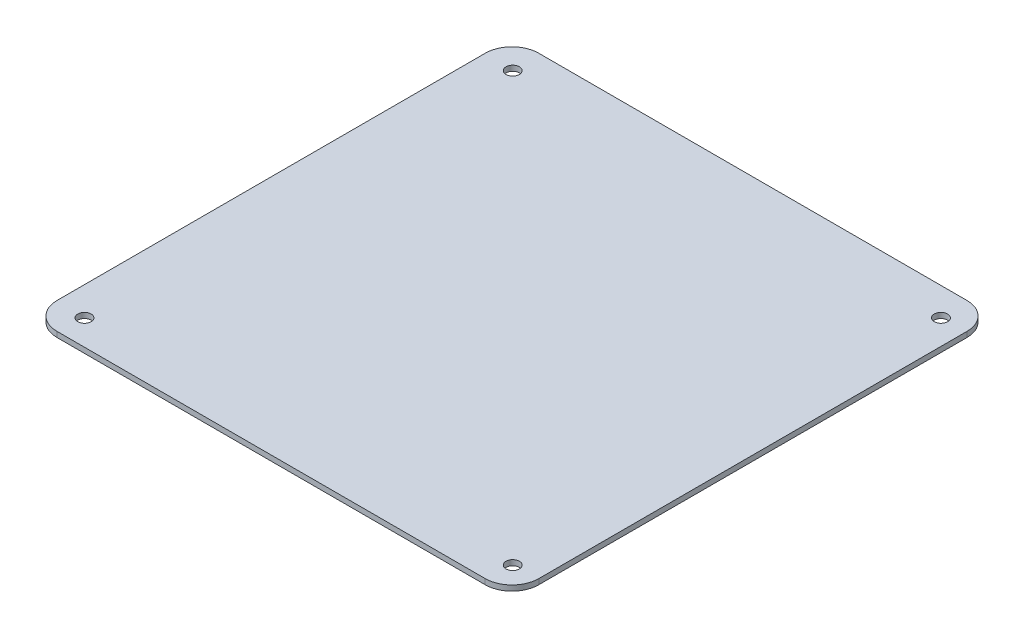
ISO-10303-21;
HEADER;
FILE_DESCRIPTION(('STEP AP214'),'2;1');
FILE_NAME('part.step','',(''),(''),'','','');
FILE_SCHEMA(('AUTOMOTIVE_DESIGN { 1 0 10303 214 1 1 1 1 }'));
ENDSEC;
DATA;
#1=APPLICATION_CONTEXT('core data for automotive mechanical design processes');
#2=APPLICATION_PROTOCOL_DEFINITION('international standard','automotive_design',2000,#1);
#3=PRODUCT_CONTEXT('',#1,'mechanical');
#4=PRODUCT('Part','Part','',(#3));
#5=PRODUCT_RELATED_PRODUCT_CATEGORY('part','',(#4));
#6=PRODUCT_DEFINITION_FORMATION('','',#4);
#7=PRODUCT_DEFINITION_CONTEXT('part definition',#1,'design');
#8=PRODUCT_DEFINITION('design','',#6,#7);
#9=PRODUCT_DEFINITION_SHAPE('','',#8);
#10=(LENGTH_UNIT() NAMED_UNIT(*) SI_UNIT(.MILLI.,.METRE.));
#11=(NAMED_UNIT(*) PLANE_ANGLE_UNIT() SI_UNIT($,.RADIAN.));
#12=(NAMED_UNIT(*) SI_UNIT($,.STERADIAN.) SOLID_ANGLE_UNIT());
#13=UNCERTAINTY_MEASURE_WITH_UNIT(LENGTH_MEASURE(1.E-05),#10,'distance_accuracy_value','');
#14=(GEOMETRIC_REPRESENTATION_CONTEXT(3) GLOBAL_UNCERTAINTY_ASSIGNED_CONTEXT((#13)) GLOBAL_UNIT_ASSIGNED_CONTEXT((#10,
#11,#12)) REPRESENTATION_CONTEXT('',''));
#15=CARTESIAN_POINT('',(0.,0.,0.));
#16=DIRECTION('',(0.,0.,1.));
#17=DIRECTION('',(1.,0.,0.));
#18=AXIS2_PLACEMENT_3D('',#15,#16,#17);
#19=CARTESIAN_POINT('',(0.,2.,0.));
#20=DIRECTION('',(0.,1.,0.));
#21=DIRECTION('',(0.,0.,1.));
#22=AXIS2_PLACEMENT_3D('',#19,#20,#21);
#23=PLANE('',#22);
#24=CARTESIAN_POINT('',(-90.9856232894034,2.,109.612029394271));
#25=DIRECTION('',(0.,1.,0.));
#26=DIRECTION('',(0.,0.,1.));
#27=AXIS2_PLACEMENT_3D('',#24,#25,#26);
#28=CIRCLE('',#27,2.5);
#29=CARTESIAN_POINT('',(-90.9856232894034,2.,112.112029394271));
#30=VERTEX_POINT('',#29);
#31=EDGE_CURVE('E217',#30,#30,#28,.T.);
#32=ORIENTED_EDGE('',*,*,#31,.F.);
#33=EDGE_LOOP('',(#32));
#34=FACE_BOUND('',#33,.T.);
#35=CARTESIAN_POINT('',(-90.9856232894034,2.,-50.3879706057294));
#36=DIRECTION('',(0.,1.,0.));
#37=DIRECTION('',(0.,0.,1.));
#38=AXIS2_PLACEMENT_3D('',#35,#36,#37);
#39=CIRCLE('',#38,2.5);
#40=CARTESIAN_POINT('',(-90.9856232894034,2.,-47.8879706057294));
#41=VERTEX_POINT('',#40);
#42=EDGE_CURVE('E136',#41,#41,#39,.T.);
#43=ORIENTED_EDGE('',*,*,#42,.F.);
#44=EDGE_LOOP('',(#43));
#45=FACE_BOUND('',#44,.T.);
#46=DIRECTION('',(-1.,0.,0.));
#47=VECTOR('',#46,1.);
#48=CARTESIAN_POINT('',(-101.746430923325,2.,-60.8823529411765));
#49=LINE('',#48,#47);
#50=CARTESIAN_POINT('',(68.2535690766746,2.,-60.8823529411765));
#51=VERTEX_POINT('',#50);
#52=CARTESIAN_POINT('',(-91.7464309233254,2.,-60.8823529411765));
#53=VERTEX_POINT('',#52);
#54=EDGE_CURVE('E147',#51,#53,#49,.T.);
#55=ORIENTED_EDGE('',*,*,#54,.T.);
#56=CARTESIAN_POINT('',(-91.7464309233254,2.,-50.8823529411765));
#57=DIRECTION('',(0.,1.,0.));
#58=DIRECTION('',(0.,0.,1.));
#59=AXIS2_PLACEMENT_3D('',#56,#57,#58);
#60=CIRCLE('',#59,10.);
#61=CARTESIAN_POINT('',(-101.746430923325,2.,-50.8823529411765));
#62=VERTEX_POINT('',#61);
#63=EDGE_CURVE('E177',#53,#62,#60,.T.);
#64=ORIENTED_EDGE('',*,*,#63,.T.);
#65=DIRECTION('',(0.,0.,1.));
#66=VECTOR('',#65,1.);
#67=CARTESIAN_POINT('',(-101.746430923325,2.,-60.8823529411765));
#68=LINE('',#67,#66);
#69=CARTESIAN_POINT('',(-101.746430923325,2.,109.117647058823));
#70=VERTEX_POINT('',#69);
#71=EDGE_CURVE('E126',#62,#70,#68,.T.);
#72=ORIENTED_EDGE('',*,*,#71,.T.);
#73=CARTESIAN_POINT('',(-91.7464309233253,2.,109.117647058824));
#74=DIRECTION('',(0.,1.,0.));
#75=DIRECTION('',(0.,0.,1.));
#76=AXIS2_PLACEMENT_3D('',#73,#74,#75);
#77=CIRCLE('',#76,10.);
#78=CARTESIAN_POINT('',(-91.7464309233253,2.,119.117647058824));
#79=VERTEX_POINT('',#78);
#80=EDGE_CURVE('E174',#70,#79,#77,.T.);
#81=ORIENTED_EDGE('',*,*,#80,.T.);
#82=DIRECTION('',(1.,0.,0.));
#83=VECTOR('',#82,1.);
#84=CARTESIAN_POINT('',(-101.746430923325,2.,119.117647058824));
#85=LINE('',#84,#83);
#86=CARTESIAN_POINT('',(68.2535690766746,2.,119.117647058824));
#87=VERTEX_POINT('',#86);
#88=EDGE_CURVE('E203',#79,#87,#85,.T.);
#89=ORIENTED_EDGE('',*,*,#88,.T.);
#90=CARTESIAN_POINT('',(68.2535690766747,2.,109.117647058824));
#91=DIRECTION('',(0.,1.,0.));
#92=DIRECTION('',(0.,0.,1.));
#93=AXIS2_PLACEMENT_3D('',#90,#91,#92);
#94=CIRCLE('',#93,10.);
#95=CARTESIAN_POINT('',(78.2535690766747,2.,109.117647058823));
#96=VERTEX_POINT('',#95);
#97=EDGE_CURVE('E60',#87,#96,#94,.T.);
#98=ORIENTED_EDGE('',*,*,#97,.T.);
#99=DIRECTION('',(0.,0.,-1.));
#100=VECTOR('',#99,1.);
#101=CARTESIAN_POINT('',(78.2535690766746,2.,-60.8823529411765));
#102=LINE('',#101,#100);
#103=CARTESIAN_POINT('',(78.2535690766746,2.,-50.8823529411765));
#104=VERTEX_POINT('',#103);
#105=EDGE_CURVE('E191',#96,#104,#102,.T.);
#106=ORIENTED_EDGE('',*,*,#105,.T.);
#107=CARTESIAN_POINT('',(68.2535690766746,2.,-50.8823529411765));
#108=DIRECTION('',(0.,1.,0.));
#109=DIRECTION('',(0.,0.,1.));
#110=AXIS2_PLACEMENT_3D('',#107,#108,#109);
#111=CIRCLE('',#110,10.);
#112=EDGE_CURVE('E171',#104,#51,#111,.T.);
#113=ORIENTED_EDGE('',*,*,#112,.T.);
#114=EDGE_LOOP('',(#55,#64,#72,#81,#89,#98,#106,#113));
#115=FACE_BOUND('',#114,.T.);
#116=CARTESIAN_POINT('',(69.0143767105966,2.,-50.3879706057294));
#117=DIRECTION('',(0.,1.,0.));
#118=DIRECTION('',(0.,0.,1.));
#119=AXIS2_PLACEMENT_3D('',#116,#117,#118);
#120=CIRCLE('',#119,2.5);
#121=CARTESIAN_POINT('',(69.0143767105966,2.,-47.8879706057294));
#122=VERTEX_POINT('',#121);
#123=EDGE_CURVE('E211',#122,#122,#120,.T.);
#124=ORIENTED_EDGE('',*,*,#123,.F.);
#125=EDGE_LOOP('',(#124));
#126=FACE_BOUND('',#125,.T.);
#127=CARTESIAN_POINT('',(69.0143767105966,2.,109.612029394271));
#128=DIRECTION('',(0.,1.,0.));
#129=DIRECTION('',(0.,0.,1.));
#130=AXIS2_PLACEMENT_3D('',#127,#128,#129);
#131=CIRCLE('',#130,2.5);
#132=CARTESIAN_POINT('',(69.0143767105966,2.,112.112029394271));
#133=VERTEX_POINT('',#132);
#134=EDGE_CURVE('E225',#133,#133,#131,.T.);
#135=ORIENTED_EDGE('',*,*,#134,.F.);
#136=EDGE_LOOP('',(#135));
#137=FACE_BOUND('',#136,.T.);
#138=ADVANCED_FACE('F39',(#34,#45,#115,#126,#137),#23,.T.);
#139=CARTESIAN_POINT('',(0.,0.,0.));
#140=DIRECTION('',(0.,1.,0.));
#141=DIRECTION('',(0.,0.,1.));
#142=AXIS2_PLACEMENT_3D('',#139,#140,#141);
#143=PLANE('',#142);
#144=DIRECTION('',(0.,0.,1.));
#145=VECTOR('',#144,1.);
#146=CARTESIAN_POINT('',(-101.746430923325,0.,-60.8823529411765));
#147=LINE('',#146,#145);
#148=CARTESIAN_POINT('',(-101.746430923325,0.,-50.8823529411765));
#149=VERTEX_POINT('',#148);
#150=CARTESIAN_POINT('',(-101.746430923325,0.,109.117647058823));
#151=VERTEX_POINT('',#150);
#152=EDGE_CURVE('E123',#149,#151,#147,.T.);
#153=ORIENTED_EDGE('',*,*,#152,.F.);
#154=CARTESIAN_POINT('',(-91.7464309233254,0.,-50.8823529411765));
#155=DIRECTION('',(0.,1.,0.));
#156=DIRECTION('',(0.,0.,1.));
#157=AXIS2_PLACEMENT_3D('',#154,#155,#156);
#158=CIRCLE('',#157,10.);
#159=CARTESIAN_POINT('',(-91.7464309233254,0.,-60.8823529411765));
#160=VERTEX_POINT('',#159);
#161=EDGE_CURVE('E105',#149,#160,#158,.F.);
#162=ORIENTED_EDGE('',*,*,#161,.T.);
#163=DIRECTION('',(-1.,0.,0.));
#164=VECTOR('',#163,1.);
#165=CARTESIAN_POINT('',(-101.746430923325,0.,-60.8823529411765));
#166=LINE('',#165,#164);
#167=CARTESIAN_POINT('',(68.2535690766746,0.,-60.8823529411765));
#168=VERTEX_POINT('',#167);
#169=EDGE_CURVE('E152',#168,#160,#166,.T.);
#170=ORIENTED_EDGE('',*,*,#169,.F.);
#171=CARTESIAN_POINT('',(68.2535690766746,0.,-50.8823529411765));
#172=DIRECTION('',(0.,1.,0.));
#173=DIRECTION('',(0.,0.,1.));
#174=AXIS2_PLACEMENT_3D('',#171,#172,#173);
#175=CIRCLE('',#174,10.);
#176=CARTESIAN_POINT('',(78.2535690766746,0.,-50.8823529411765));
#177=VERTEX_POINT('',#176);
#178=EDGE_CURVE('E159',#168,#177,#175,.F.);
#179=ORIENTED_EDGE('',*,*,#178,.T.);
#180=DIRECTION('',(0.,0.,-1.));
#181=VECTOR('',#180,1.);
#182=CARTESIAN_POINT('',(78.2535690766746,0.,-60.8823529411765));
#183=LINE('',#182,#181);
#184=CARTESIAN_POINT('',(78.2535690766747,0.,109.117647058823));
#185=VERTEX_POINT('',#184);
#186=EDGE_CURVE('E141',#185,#177,#183,.T.);
#187=ORIENTED_EDGE('',*,*,#186,.F.);
#188=CARTESIAN_POINT('',(68.2535690766747,0.,109.117647058824));
#189=DIRECTION('',(0.,1.,0.));
#190=DIRECTION('',(0.,0.,1.));
#191=AXIS2_PLACEMENT_3D('',#188,#189,#190);
#192=CIRCLE('',#191,10.);
#193=CARTESIAN_POINT('',(68.2535690766746,0.,119.117647058824));
#194=VERTEX_POINT('',#193);
#195=EDGE_CURVE('E128',#185,#194,#192,.F.);
#196=ORIENTED_EDGE('',*,*,#195,.T.);
#197=DIRECTION('',(1.,0.,0.));
#198=VECTOR('',#197,1.);
#199=CARTESIAN_POINT('',(-101.746430923325,0.,119.117647058824));
#200=LINE('',#199,#198);
#201=CARTESIAN_POINT('',(-91.7464309233253,0.,119.117647058824));
#202=VERTEX_POINT('',#201);
#203=EDGE_CURVE('E135',#202,#194,#200,.T.);
#204=ORIENTED_EDGE('',*,*,#203,.F.);
#205=CARTESIAN_POINT('',(-91.7464309233253,0.,109.117647058824));
#206=DIRECTION('',(0.,1.,0.));
#207=DIRECTION('',(0.,0.,1.));
#208=AXIS2_PLACEMENT_3D('',#205,#206,#207);
#209=CIRCLE('',#208,10.);
#210=EDGE_CURVE('E117',#202,#151,#209,.F.);
#211=ORIENTED_EDGE('',*,*,#210,.T.);
#212=EDGE_LOOP('',(#153,#162,#170,#179,#187,#196,#204,#211));
#213=FACE_BOUND('',#212,.T.);
#214=CARTESIAN_POINT('',(-90.9856232894034,0.,-50.3879706057294));
#215=DIRECTION('',(0.,1.,0.));
#216=DIRECTION('',(0.,0.,1.));
#217=AXIS2_PLACEMENT_3D('',#214,#215,#216);
#218=CIRCLE('',#217,2.5);
#219=CARTESIAN_POINT('',(-90.9856232894034,0.,-47.8879706057294));
#220=VERTEX_POINT('',#219);
#221=EDGE_CURVE('E144',#220,#220,#218,.T.);
#222=ORIENTED_EDGE('',*,*,#221,.T.);
#223=EDGE_LOOP('',(#222));
#224=FACE_BOUND('',#223,.T.);
#225=CARTESIAN_POINT('',(69.0143767105966,0.,-50.3879706057294));
#226=DIRECTION('',(0.,1.,0.));
#227=DIRECTION('',(0.,0.,1.));
#228=AXIS2_PLACEMENT_3D('',#225,#226,#227);
#229=CIRCLE('',#228,2.5);
#230=CARTESIAN_POINT('',(69.0143767105966,0.,-47.8879706057294));
#231=VERTEX_POINT('',#230);
#232=EDGE_CURVE('E213',#231,#231,#229,.T.);
#233=ORIENTED_EDGE('',*,*,#232,.T.);
#234=EDGE_LOOP('',(#233));
#235=FACE_BOUND('',#234,.T.);
#236=CARTESIAN_POINT('',(-90.9856232894034,0.,109.612029394271));
#237=DIRECTION('',(0.,1.,0.));
#238=DIRECTION('',(0.,0.,1.));
#239=AXIS2_PLACEMENT_3D('',#236,#237,#238);
#240=CIRCLE('',#239,2.5);
#241=CARTESIAN_POINT('',(-90.9856232894034,0.,112.112029394271));
#242=VERTEX_POINT('',#241);
#243=EDGE_CURVE('E221',#242,#242,#240,.T.);
#244=ORIENTED_EDGE('',*,*,#243,.T.);
#245=EDGE_LOOP('',(#244));
#246=FACE_BOUND('',#245,.T.);
#247=CARTESIAN_POINT('',(69.0143767105966,0.,109.612029394271));
#248=DIRECTION('',(0.,1.,0.));
#249=DIRECTION('',(0.,0.,1.));
#250=AXIS2_PLACEMENT_3D('',#247,#248,#249);
#251=CIRCLE('',#250,2.5);
#252=CARTESIAN_POINT('',(69.0143767105966,0.,112.112029394271));
#253=VERTEX_POINT('',#252);
#254=EDGE_CURVE('E229',#253,#253,#251,.T.);
#255=ORIENTED_EDGE('',*,*,#254,.T.);
#256=EDGE_LOOP('',(#255));
#257=FACE_BOUND('',#256,.T.);
#258=ADVANCED_FACE('F131',(#213,#224,#235,#246,#257),#143,.F.);
#259=CARTESIAN_POINT('',(-101.746430923325,2.,-60.8823529411765));
#260=DIRECTION('',(1.,0.,0.));
#261=DIRECTION('',(0.,0.,-1.));
#262=AXIS2_PLACEMENT_3D('',#259,#260,#261);
#263=PLANE('',#262);
#264=ORIENTED_EDGE('',*,*,#71,.F.);
#265=DIRECTION('',(0.,-1.,0.));
#266=VECTOR('',#265,1.);
#267=CARTESIAN_POINT('',(-101.746430923325,2.,-50.8823529411765));
#268=LINE('',#267,#266);
#269=EDGE_CURVE('E109',#62,#149,#268,.T.);
#270=ORIENTED_EDGE('',*,*,#269,.T.);
#271=ORIENTED_EDGE('',*,*,#152,.T.);
#272=DIRECTION('',(0.,-1.,0.));
#273=VECTOR('',#272,1.);
#274=CARTESIAN_POINT('',(-101.746430923325,2.,109.117647058824));
#275=LINE('',#274,#273);
#276=EDGE_CURVE('E129',#151,#70,#275,.F.);
#277=ORIENTED_EDGE('',*,*,#276,.T.);
#278=EDGE_LOOP('',(#264,#270,#271,#277));
#279=FACE_BOUND('',#278,.T.);
#280=ADVANCED_FACE('F122',(#279),#263,.F.);
#281=CARTESIAN_POINT('',(-101.746430923325,2.,119.117647058824));
#282=DIRECTION('',(0.,0.,-1.));
#283=DIRECTION('',(-1.,0.,0.));
#284=AXIS2_PLACEMENT_3D('',#281,#282,#283);
#285=PLANE('',#284);
#286=ORIENTED_EDGE('',*,*,#88,.F.);
#287=DIRECTION('',(0.,-1.,0.));
#288=VECTOR('',#287,1.);
#289=CARTESIAN_POINT('',(-91.7464309233253,2.,119.117647058824));
#290=LINE('',#289,#288);
#291=EDGE_CURVE('E183',#79,#202,#290,.T.);
#292=ORIENTED_EDGE('',*,*,#291,.T.);
#293=ORIENTED_EDGE('',*,*,#203,.T.);
#294=DIRECTION('',(0.,-1.,0.));
#295=VECTOR('',#294,1.);
#296=CARTESIAN_POINT('',(68.2535690766747,2.,119.117647058824));
#297=LINE('',#296,#295);
#298=EDGE_CURVE('E180',#194,#87,#297,.F.);
#299=ORIENTED_EDGE('',*,*,#298,.T.);
#300=EDGE_LOOP('',(#286,#292,#293,#299));
#301=FACE_BOUND('',#300,.T.);
#302=ADVANCED_FACE('F257',(#301),#285,.F.);
#303=CARTESIAN_POINT('',(78.2535690766746,2.,-60.8823529411765));
#304=DIRECTION('',(-1.,0.,0.));
#305=DIRECTION('',(0.,0.,1.));
#306=AXIS2_PLACEMENT_3D('',#303,#304,#305);
#307=PLANE('',#306);
#308=ORIENTED_EDGE('',*,*,#186,.T.);
#309=DIRECTION('',(0.,-1.,0.));
#310=VECTOR('',#309,1.);
#311=CARTESIAN_POINT('',(78.2535690766746,2.,-50.8823529411765));
#312=LINE('',#311,#310);
#313=EDGE_CURVE('E11',#177,#104,#312,.F.);
#314=ORIENTED_EDGE('',*,*,#313,.T.);
#315=ORIENTED_EDGE('',*,*,#105,.F.);
#316=DIRECTION('',(0.,-1.,0.));
#317=VECTOR('',#316,1.);
#318=CARTESIAN_POINT('',(78.2535690766747,2.,109.117647058824));
#319=LINE('',#318,#317);
#320=EDGE_CURVE('E48',#96,#185,#319,.T.);
#321=ORIENTED_EDGE('',*,*,#320,.T.);
#322=EDGE_LOOP('',(#308,#314,#315,#321));
#323=FACE_BOUND('',#322,.T.);
#324=ADVANCED_FACE('F190',(#323),#307,.F.);
#325=CARTESIAN_POINT('',(-101.746430923325,2.,-60.8823529411765));
#326=DIRECTION('',(0.,0.,1.));
#327=DIRECTION('',(1.,0.,0.));
#328=AXIS2_PLACEMENT_3D('',#325,#326,#327);
#329=PLANE('',#328);
#330=ORIENTED_EDGE('',*,*,#169,.T.);
#331=DIRECTION('',(0.,-1.,0.));
#332=VECTOR('',#331,1.);
#333=CARTESIAN_POINT('',(-91.7464309233254,2.,-60.8823529411765));
#334=LINE('',#333,#332);
#335=EDGE_CURVE('E110',#160,#53,#334,.F.);
#336=ORIENTED_EDGE('',*,*,#335,.T.);
#337=ORIENTED_EDGE('',*,*,#54,.F.);
#338=DIRECTION('',(0.,-1.,0.));
#339=VECTOR('',#338,1.);
#340=CARTESIAN_POINT('',(68.2535690766746,2.,-60.8823529411765));
#341=LINE('',#340,#339);
#342=EDGE_CURVE('E116',#51,#168,#341,.T.);
#343=ORIENTED_EDGE('',*,*,#342,.T.);
#344=EDGE_LOOP('',(#330,#336,#337,#343));
#345=FACE_BOUND('',#344,.T.);
#346=ADVANCED_FACE('F199',(#345),#329,.F.);
#347=CARTESIAN_POINT('',(-90.9856232894034,2.,-50.3879706057294));
#348=DIRECTION('',(0.,-1.,0.));
#349=DIRECTION('',(0.,0.,-1.));
#350=AXIS2_PLACEMENT_3D('',#347,#348,#349);
#351=CYLINDRICAL_SURFACE('',#350,2.5);
#352=ORIENTED_EDGE('',*,*,#42,.T.);
#353=EDGE_LOOP('',(#352));
#354=FACE_BOUND('',#353,.T.);
#355=ORIENTED_EDGE('',*,*,#221,.F.);
#356=EDGE_LOOP('',(#355));
#357=FACE_BOUND('',#356,.T.);
#358=ADVANCED_FACE('F250',(#354,#357),#351,.F.);
#359=CARTESIAN_POINT('',(69.0143767105966,2.,-50.3879706057294));
#360=DIRECTION('',(0.,-1.,0.));
#361=DIRECTION('',(0.,0.,-1.));
#362=AXIS2_PLACEMENT_3D('',#359,#360,#361);
#363=CYLINDRICAL_SURFACE('',#362,2.5);
#364=ORIENTED_EDGE('',*,*,#123,.T.);
#365=EDGE_LOOP('',(#364));
#366=FACE_BOUND('',#365,.T.);
#367=ORIENTED_EDGE('',*,*,#232,.F.);
#368=EDGE_LOOP('',(#367));
#369=FACE_BOUND('',#368,.T.);
#370=ADVANCED_FACE('F281',(#366,#369),#363,.F.);
#371=CARTESIAN_POINT('',(-90.9856232894034,2.,109.612029394271));
#372=DIRECTION('',(0.,-1.,0.));
#373=DIRECTION('',(0.,0.,-1.));
#374=AXIS2_PLACEMENT_3D('',#371,#372,#373);
#375=CYLINDRICAL_SURFACE('',#374,2.5);
#376=ORIENTED_EDGE('',*,*,#31,.T.);
#377=EDGE_LOOP('',(#376));
#378=FACE_BOUND('',#377,.T.);
#379=ORIENTED_EDGE('',*,*,#243,.F.);
#380=EDGE_LOOP('',(#379));
#381=FACE_BOUND('',#380,.T.);
#382=ADVANCED_FACE('F284',(#378,#381),#375,.F.);
#383=CARTESIAN_POINT('',(69.0143767105966,2.,109.612029394271));
#384=DIRECTION('',(0.,-1.,0.));
#385=DIRECTION('',(0.,0.,-1.));
#386=AXIS2_PLACEMENT_3D('',#383,#384,#385);
#387=CYLINDRICAL_SURFACE('',#386,2.5);
#388=ORIENTED_EDGE('',*,*,#134,.T.);
#389=EDGE_LOOP('',(#388));
#390=FACE_BOUND('',#389,.T.);
#391=ORIENTED_EDGE('',*,*,#254,.F.);
#392=EDGE_LOOP('',(#391));
#393=FACE_BOUND('',#392,.T.);
#394=ADVANCED_FACE('F237',(#390,#393),#387,.F.);
#395=CARTESIAN_POINT('',(-91.7464309233254,2.,-50.8823529411765));
#396=DIRECTION('',(0.,-1.,0.));
#397=DIRECTION('',(0.,0.,-1.));
#398=AXIS2_PLACEMENT_3D('',#395,#396,#397);
#399=CYLINDRICAL_SURFACE('',#398,10.);
#400=ORIENTED_EDGE('',*,*,#63,.F.);
#401=ORIENTED_EDGE('',*,*,#335,.F.);
#402=ORIENTED_EDGE('',*,*,#161,.F.);
#403=ORIENTED_EDGE('',*,*,#269,.F.);
#404=EDGE_LOOP('',(#400,#401,#402,#403));
#405=FACE_BOUND('',#404,.T.);
#406=ADVANCED_FACE('F108',(#405),#399,.T.);
#407=CARTESIAN_POINT('',(-91.7464309233253,2.,109.117647058824));
#408=DIRECTION('',(0.,-1.,0.));
#409=DIRECTION('',(0.,0.,-1.));
#410=AXIS2_PLACEMENT_3D('',#407,#408,#409);
#411=CYLINDRICAL_SURFACE('',#410,10.);
#412=ORIENTED_EDGE('',*,*,#80,.F.);
#413=ORIENTED_EDGE('',*,*,#276,.F.);
#414=ORIENTED_EDGE('',*,*,#210,.F.);
#415=ORIENTED_EDGE('',*,*,#291,.F.);
#416=EDGE_LOOP('',(#412,#413,#414,#415));
#417=FACE_BOUND('',#416,.T.);
#418=ADVANCED_FACE('F265',(#417),#411,.T.);
#419=CARTESIAN_POINT('',(68.2535690766746,2.,-50.8823529411765));
#420=DIRECTION('',(0.,-1.,0.));
#421=DIRECTION('',(0.,0.,-1.));
#422=AXIS2_PLACEMENT_3D('',#419,#420,#421);
#423=CYLINDRICAL_SURFACE('',#422,10.);
#424=ORIENTED_EDGE('',*,*,#112,.F.);
#425=ORIENTED_EDGE('',*,*,#313,.F.);
#426=ORIENTED_EDGE('',*,*,#178,.F.);
#427=ORIENTED_EDGE('',*,*,#342,.F.);
#428=EDGE_LOOP('',(#424,#425,#426,#427));
#429=FACE_BOUND('',#428,.T.);
#430=ADVANCED_FACE('F196',(#429),#423,.T.);
#431=CARTESIAN_POINT('',(68.2535690766747,2.,109.117647058824));
#432=DIRECTION('',(0.,-1.,0.));
#433=DIRECTION('',(0.,0.,-1.));
#434=AXIS2_PLACEMENT_3D('',#431,#432,#433);
#435=CYLINDRICAL_SURFACE('',#434,10.);
#436=ORIENTED_EDGE('',*,*,#97,.F.);
#437=ORIENTED_EDGE('',*,*,#298,.F.);
#438=ORIENTED_EDGE('',*,*,#195,.F.);
#439=ORIENTED_EDGE('',*,*,#320,.F.);
#440=EDGE_LOOP('',(#436,#437,#438,#439));
#441=FACE_BOUND('',#440,.T.);
#442=ADVANCED_FACE('F41',(#441),#435,.T.);
#443=CLOSED_SHELL('',(#138,#258,#280,#302,#324,#346,#358,#370,#382,#394,#406,#418,#430,#442));
#444=MANIFOLD_SOLID_BREP('B2',#443);
#445=ADVANCED_BREP_SHAPE_REPRESENTATION('',(#18,#444),#14);
#446=SHAPE_DEFINITION_REPRESENTATION(#9,#445);
ENDSEC;
END-ISO-10303-21;
